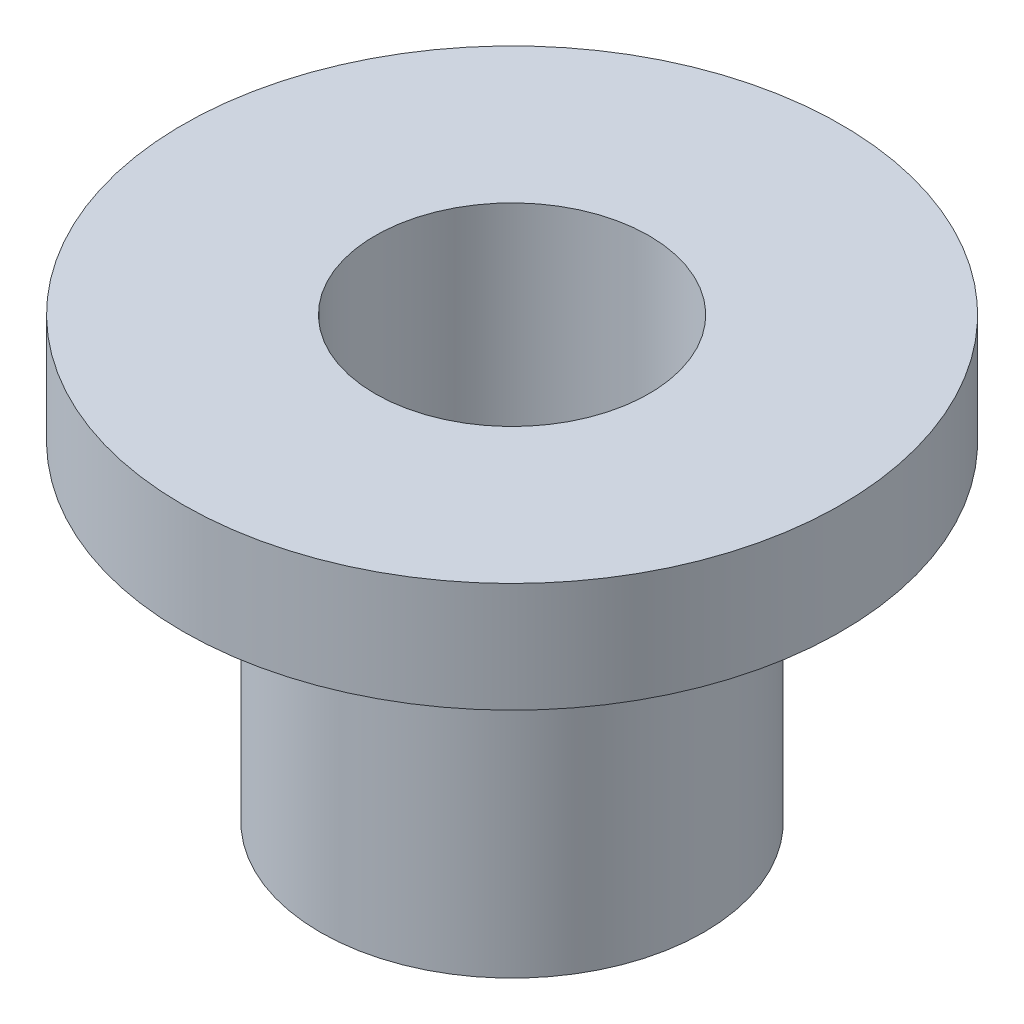
ISO-10303-21;
HEADER;
FILE_DESCRIPTION(('STEP AP214'),'2;1');
FILE_NAME('part.step','',(''),(''),'','','');
FILE_SCHEMA(('AUTOMOTIVE_DESIGN { 1 0 10303 214 1 1 1 1 }'));
ENDSEC;
DATA;
#1=APPLICATION_CONTEXT('core data for automotive mechanical design processes');
#2=APPLICATION_PROTOCOL_DEFINITION('international standard','automotive_design',2000,#1);
#3=PRODUCT_CONTEXT('',#1,'mechanical');
#4=PRODUCT('Part','Part','',(#3));
#5=PRODUCT_RELATED_PRODUCT_CATEGORY('part','',(#4));
#6=PRODUCT_DEFINITION_FORMATION('','',#4);
#7=PRODUCT_DEFINITION_CONTEXT('part definition',#1,'design');
#8=PRODUCT_DEFINITION('design','',#6,#7);
#9=PRODUCT_DEFINITION_SHAPE('','',#8);
#10=(LENGTH_UNIT() NAMED_UNIT(*) SI_UNIT(.MILLI.,.METRE.));
#11=(NAMED_UNIT(*) PLANE_ANGLE_UNIT() SI_UNIT($,.RADIAN.));
#12=(NAMED_UNIT(*) SI_UNIT($,.STERADIAN.) SOLID_ANGLE_UNIT());
#13=UNCERTAINTY_MEASURE_WITH_UNIT(LENGTH_MEASURE(1.E-05),#10,'distance_accuracy_value','');
#14=(GEOMETRIC_REPRESENTATION_CONTEXT(3) GLOBAL_UNCERTAINTY_ASSIGNED_CONTEXT((#13)) GLOBAL_UNIT_ASSIGNED_CONTEXT((#10,
#11,#12)) REPRESENTATION_CONTEXT('',''));
#15=CARTESIAN_POINT('',(0.,0.,0.));
#16=DIRECTION('',(0.,0.,1.));
#17=DIRECTION('',(1.,0.,0.));
#18=AXIS2_PLACEMENT_3D('',#15,#16,#17);
#19=CARTESIAN_POINT('',(0.,0.,0.));
#20=DIRECTION('',(0.,1.,0.));
#21=DIRECTION('',(0.,0.,1.));
#22=AXIS2_PLACEMENT_3D('',#19,#20,#21);
#23=CYLINDRICAL_SURFACE('',#22,9.525);
#24=CARTESIAN_POINT('',(0.,-3.175,0.));
#25=DIRECTION('',(0.,1.,0.));
#26=DIRECTION('',(0.,0.,1.));
#27=AXIS2_PLACEMENT_3D('',#24,#25,#26);
#28=CIRCLE('',#27,9.525);
#29=CARTESIAN_POINT('',(0.,-3.175,9.525));
#30=VERTEX_POINT('',#29);
#31=EDGE_CURVE('E10',#30,#30,#28,.T.);
#32=ORIENTED_EDGE('',*,*,#31,.T.);
#33=EDGE_LOOP('',(#32));
#34=FACE_BOUND('',#33,.T.);
#35=CARTESIAN_POINT('',(0.,0.,0.));
#36=DIRECTION('',(0.,1.,0.));
#37=DIRECTION('',(0.,0.,1.));
#38=AXIS2_PLACEMENT_3D('',#35,#36,#37);
#39=CIRCLE('',#38,9.525);
#40=CARTESIAN_POINT('',(0.,0.,9.525));
#41=VERTEX_POINT('',#40);
#42=EDGE_CURVE('E51',#41,#41,#39,.T.);
#43=ORIENTED_EDGE('',*,*,#42,.F.);
#44=EDGE_LOOP('',(#43));
#45=FACE_BOUND('',#44,.T.);
#46=ADVANCED_FACE('F29',(#34,#45),#23,.T.);
#47=CARTESIAN_POINT('',(-9.525,-3.175,0.));
#48=DIRECTION('',(0.,-1.,0.));
#49=DIRECTION('',(0.,0.,-1.));
#50=AXIS2_PLACEMENT_3D('',#47,#48,#49);
#51=PLANE('',#50);
#52=CARTESIAN_POINT('',(0.,-3.175,0.));
#53=DIRECTION('',(0.,1.,0.));
#54=DIRECTION('',(0.,0.,1.));
#55=AXIS2_PLACEMENT_3D('',#52,#53,#54);
#56=CIRCLE('',#55,5.5499);
#57=CARTESIAN_POINT('',(0.,-3.175,5.5499));
#58=VERTEX_POINT('',#57);
#59=EDGE_CURVE('E35',#58,#58,#56,.T.);
#60=ORIENTED_EDGE('',*,*,#59,.T.);
#61=EDGE_LOOP('',(#60));
#62=FACE_BOUND('',#61,.T.);
#63=ORIENTED_EDGE('',*,*,#31,.F.);
#64=EDGE_LOOP('',(#63));
#65=FACE_BOUND('',#64,.T.);
#66=ADVANCED_FACE('F59',(#62,#65),#51,.T.);
#67=CARTESIAN_POINT('',(0.,0.,0.));
#68=DIRECTION('',(0.,1.,0.));
#69=DIRECTION('',(0.,0.,1.));
#70=AXIS2_PLACEMENT_3D('',#67,#68,#69);
#71=CYLINDRICAL_SURFACE('',#70,5.5499);
#72=CARTESIAN_POINT('',(0.,-12.7,0.));
#73=DIRECTION('',(0.,1.,0.));
#74=DIRECTION('',(0.,0.,1.));
#75=AXIS2_PLACEMENT_3D('',#72,#73,#74);
#76=CIRCLE('',#75,5.5499);
#77=CARTESIAN_POINT('',(0.,-12.7,5.5499));
#78=VERTEX_POINT('',#77);
#79=EDGE_CURVE('E39',#78,#78,#76,.T.);
#80=ORIENTED_EDGE('',*,*,#79,.T.);
#81=EDGE_LOOP('',(#80));
#82=FACE_BOUND('',#81,.T.);
#83=ORIENTED_EDGE('',*,*,#59,.F.);
#84=EDGE_LOOP('',(#83));
#85=FACE_BOUND('',#84,.T.);
#86=ADVANCED_FACE('F63',(#82,#85),#71,.T.);
#87=CARTESIAN_POINT('',(-5.5499,-12.7,0.));
#88=DIRECTION('',(0.,-1.,0.));
#89=DIRECTION('',(0.,0.,-1.));
#90=AXIS2_PLACEMENT_3D('',#87,#88,#89);
#91=PLANE('',#90);
#92=CARTESIAN_POINT('',(0.,-12.7,0.));
#93=DIRECTION('',(0.,1.,0.));
#94=DIRECTION('',(0.,0.,1.));
#95=AXIS2_PLACEMENT_3D('',#92,#93,#94);
#96=CIRCLE('',#95,3.9624);
#97=CARTESIAN_POINT('',(0.,-12.7,3.9624));
#98=VERTEX_POINT('',#97);
#99=EDGE_CURVE('E43',#98,#98,#96,.T.);
#100=ORIENTED_EDGE('',*,*,#99,.T.);
#101=EDGE_LOOP('',(#100));
#102=FACE_BOUND('',#101,.T.);
#103=ORIENTED_EDGE('',*,*,#79,.F.);
#104=EDGE_LOOP('',(#103));
#105=FACE_BOUND('',#104,.T.);
#106=ADVANCED_FACE('F67',(#102,#105),#91,.T.);
#107=CARTESIAN_POINT('',(0.,0.,0.));
#108=DIRECTION('',(0.,1.,0.));
#109=DIRECTION('',(0.,0.,1.));
#110=AXIS2_PLACEMENT_3D('',#107,#108,#109);
#111=CYLINDRICAL_SURFACE('',#110,3.9624);
#112=CARTESIAN_POINT('',(0.,0.,0.));
#113=DIRECTION('',(0.,1.,0.));
#114=DIRECTION('',(0.,0.,1.));
#115=AXIS2_PLACEMENT_3D('',#112,#113,#114);
#116=CIRCLE('',#115,3.9624);
#117=CARTESIAN_POINT('',(0.,0.,3.9624));
#118=VERTEX_POINT('',#117);
#119=EDGE_CURVE('E48',#118,#118,#116,.T.);
#120=ORIENTED_EDGE('',*,*,#119,.T.);
#121=EDGE_LOOP('',(#120));
#122=FACE_BOUND('',#121,.T.);
#123=ORIENTED_EDGE('',*,*,#99,.F.);
#124=EDGE_LOOP('',(#123));
#125=FACE_BOUND('',#124,.T.);
#126=ADVANCED_FACE('F74',(#122,#125),#111,.F.);
#127=CARTESIAN_POINT('',(-9.525,0.,0.));
#128=DIRECTION('',(0.,1.,0.));
#129=DIRECTION('',(0.,0.,1.));
#130=AXIS2_PLACEMENT_3D('',#127,#128,#129);
#131=PLANE('',#130);
#132=ORIENTED_EDGE('',*,*,#42,.T.);
#133=EDGE_LOOP('',(#132));
#134=FACE_BOUND('',#133,.T.);
#135=ORIENTED_EDGE('',*,*,#119,.F.);
#136=EDGE_LOOP('',(#135));
#137=FACE_BOUND('',#136,.T.);
#138=ADVANCED_FACE('F55',(#134,#137),#131,.T.);
#139=CLOSED_SHELL('',(#46,#66,#86,#106,#126,#138));
#140=MANIFOLD_SOLID_BREP('B2',#139);
#141=ADVANCED_BREP_SHAPE_REPRESENTATION('',(#18,#140),#14);
#142=SHAPE_DEFINITION_REPRESENTATION(#9,#141);
ENDSEC;
END-ISO-10303-21;
